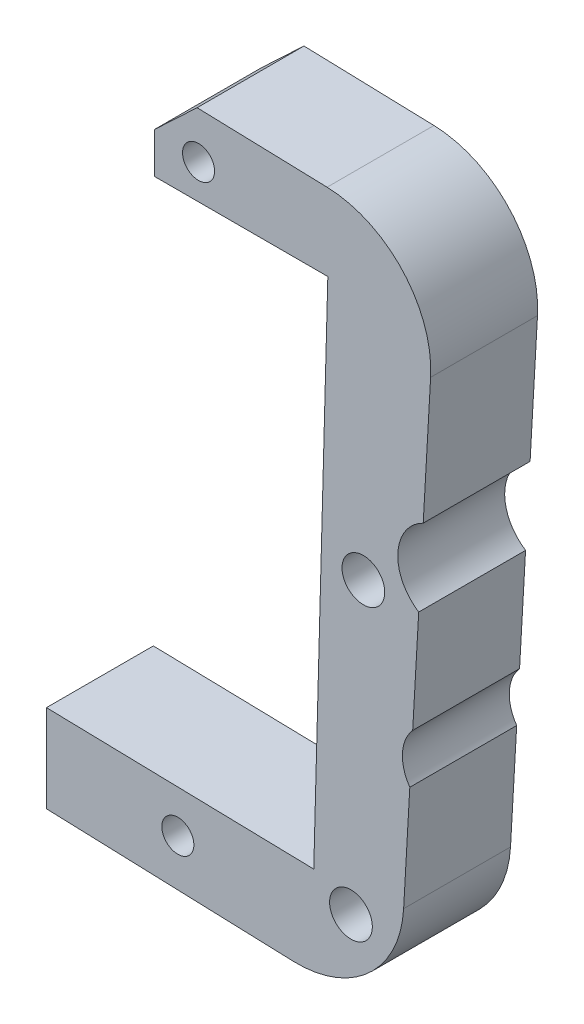
ISO-10303-21;
HEADER;
FILE_DESCRIPTION(('STEP AP214'),'2;1');
FILE_NAME('part.step','',(''),(''),'','','');
FILE_SCHEMA(('AUTOMOTIVE_DESIGN { 1 0 10303 214 1 1 1 1 }'));
ENDSEC;
DATA;
#1=APPLICATION_CONTEXT('core data for automotive mechanical design processes');
#2=APPLICATION_PROTOCOL_DEFINITION('international standard','automotive_design',2000,#1);
#3=PRODUCT_CONTEXT('',#1,'mechanical');
#4=PRODUCT('Part','Part','',(#3));
#5=PRODUCT_RELATED_PRODUCT_CATEGORY('part','',(#4));
#6=PRODUCT_DEFINITION_FORMATION('','',#4);
#7=PRODUCT_DEFINITION_CONTEXT('part definition',#1,'design');
#8=PRODUCT_DEFINITION('design','',#6,#7);
#9=PRODUCT_DEFINITION_SHAPE('','',#8);
#10=(LENGTH_UNIT() NAMED_UNIT(*) SI_UNIT(.MILLI.,.METRE.));
#11=(NAMED_UNIT(*) PLANE_ANGLE_UNIT() SI_UNIT($,.RADIAN.));
#12=(NAMED_UNIT(*) SI_UNIT($,.STERADIAN.) SOLID_ANGLE_UNIT());
#13=UNCERTAINTY_MEASURE_WITH_UNIT(LENGTH_MEASURE(1.E-05),#10,'distance_accuracy_value','');
#14=(GEOMETRIC_REPRESENTATION_CONTEXT(3) GLOBAL_UNCERTAINTY_ASSIGNED_CONTEXT((#13)) GLOBAL_UNIT_ASSIGNED_CONTEXT((#10,
#11,#12)) REPRESENTATION_CONTEXT('',''));
#15=CARTESIAN_POINT('',(0.,0.,0.));
#16=DIRECTION('',(0.,0.,1.));
#17=DIRECTION('',(1.,0.,0.));
#18=AXIS2_PLACEMENT_3D('',#15,#16,#17);
#19=CARTESIAN_POINT('',(71.9103372050038,19.8189163804485,5.));
#20=DIRECTION('',(0.,0.,-1.));
#21=DIRECTION('',(-1.,0.,0.));
#22=AXIS2_PLACEMENT_3D('',#19,#20,#21);
#23=PLANE('',#22);
#24=CARTESIAN_POINT('',(65.0760458232455,-4.95071954235128,5.));
#25=DIRECTION('',(0.,0.,1.));
#26=DIRECTION('',(1.,0.,0.));
#27=AXIS2_PLACEMENT_3D('',#24,#25,#26);
#28=CIRCLE('',#27,0.749999999999999);
#29=CARTESIAN_POINT('',(65.8260458232455,-4.95071954235128,5.));
#30=VERTEX_POINT('',#29);
#31=EDGE_CURVE('E330',#30,#30,#28,.T.);
#32=ORIENTED_EDGE('',*,*,#31,.F.);
#33=EDGE_LOOP('',(#32));
#34=FACE_BOUND('',#33,.T.);
#35=CARTESIAN_POINT('',(66.0462518315754,22.8323454487796,5.));
#36=DIRECTION('',(0.,0.,1.));
#37=DIRECTION('',(1.,0.,0.));
#38=AXIS2_PLACEMENT_3D('',#35,#36,#37);
#39=CIRCLE('',#38,0.749999999999999);
#40=CARTESIAN_POINT('',(66.7962518315754,22.8323454487796,5.));
#41=VERTEX_POINT('',#40);
#42=EDGE_CURVE('E322',#41,#41,#39,.T.);
#43=ORIENTED_EDGE('',*,*,#42,.F.);
#44=EDGE_LOOP('',(#43));
#45=FACE_BOUND('',#44,.T.);
#46=DIRECTION('',(-0.999562301749574,0.0295838625113943,0.));
#47=VECTOR('',#46,1.);
#48=CARTESIAN_POINT('',(63.9785920288581,25.0558602403801,5.));
#49=LINE('',#48,#47);
#50=CARTESIAN_POINT('',(72.0582565175607,24.8167278891964,5.));
#51=VERTEX_POINT('',#50);
#52=CARTESIAN_POINT('',(65.9777166323573,24.9966925153573,5.));
#53=VERTEX_POINT('',#52);
#54=EDGE_CURVE('E274',#51,#53,#49,.T.);
#55=ORIENTED_EDGE('',*,*,#54,.T.);
#56=DIRECTION('',(0.727716231581056,0.68587833199006,0.));
#57=VECTOR('',#56,1.);
#58=CARTESIAN_POINT('',(63.9785920288581,23.1125016879667,5.));
#59=LINE('',#58,#57);
#60=CARTESIAN_POINT('',(63.9785920288581,23.1125016879667,5.));
#61=VERTEX_POINT('',#60);
#62=EDGE_CURVE('E11',#53,#61,#59,.F.);
#63=ORIENTED_EDGE('',*,*,#62,.T.);
#64=DIRECTION('',(0.,-1.,0.));
#65=VECTOR('',#64,1.);
#66=CARTESIAN_POINT('',(63.9785920288581,21.2145614977327,5.));
#67=LINE('',#66,#65);
#68=CARTESIAN_POINT('',(63.9785920288581,21.2145614977327,5.));
#69=VERTEX_POINT('',#68);
#70=EDGE_CURVE('E166',#61,#69,#67,.T.);
#71=ORIENTED_EDGE('',*,*,#70,.T.);
#72=DIRECTION('',(1.,0.,0.));
#73=VECTOR('',#72,1.);
#74=CARTESIAN_POINT('',(72.0934757913562,21.2145614977327,5.));
#75=LINE('',#74,#73);
#76=CARTESIAN_POINT('',(72.0934757913562,21.2145614977327,5.));
#77=VERTEX_POINT('',#76);
#78=EDGE_CURVE('E161',#69,#77,#75,.T.);
#79=ORIENTED_EDGE('',*,*,#78,.T.);
#80=DIRECTION('',(-0.0270408255884992,-0.999634330018479,0.));
#81=VECTOR('',#80,1.);
#82=CARTESIAN_POINT('',(71.4351417341447,-3.12246630695344,5.));
#83=LINE('',#82,#81);
#84=CARTESIAN_POINT('',(71.4351417341447,-3.12246630695344,5.));
#85=VERTEX_POINT('',#84);
#86=EDGE_CURVE('E149',#77,#85,#83,.T.);
#87=ORIENTED_EDGE('',*,*,#86,.T.);
#88=DIRECTION('',(-0.999731963759344,0.0231516875817951,0.));
#89=VECTOR('',#88,1.);
#90=CARTESIAN_POINT('',(58.9304337087244,-2.83288359478581,5.));
#91=LINE('',#90,#89);
#92=CARTESIAN_POINT('',(58.9304337087244,-2.83288359478581,5.));
#93=VERTEX_POINT('',#92);
#94=EDGE_CURVE('E160',#85,#93,#91,.T.);
#95=ORIENTED_EDGE('',*,*,#94,.T.);
#96=DIRECTION('',(0.,-1.,0.));
#97=VECTOR('',#96,1.);
#98=CARTESIAN_POINT('',(58.9304337087244,-2.83288359478581,5.));
#99=LINE('',#98,#97);
#100=CARTESIAN_POINT('',(58.9304337087244,-6.93315341266548,5.));
#101=VERTEX_POINT('',#100);
#102=EDGE_CURVE('E301',#93,#101,#99,.T.);
#103=ORIENTED_EDGE('',*,*,#102,.T.);
#104=DIRECTION('',(0.999390827019095,-0.0348994967025162,0.));
#105=VECTOR('',#104,1.);
#106=CARTESIAN_POINT('',(58.9304337087244,-6.93315341266548,5.));
#107=LINE('',#106,#105);
#108=CARTESIAN_POINT('',(70.4737985935657,-7.33625659696834,5.));
#109=VERTEX_POINT('',#108);
#110=EDGE_CURVE('E298',#101,#109,#107,.T.);
#111=ORIENTED_EDGE('',*,*,#110,.T.);
#112=CARTESIAN_POINT('',(70.6482960770783,-2.33930246187286,5.));
#113=DIRECTION('',(0.,0.,1.));
#114=DIRECTION('',(-1.,0.,0.));
#115=AXIS2_PLACEMENT_3D('',#112,#113,#114);
#116=CIRCLE('',#115,5.);
#117=CARTESIAN_POINT('',(75.6402058210045,-2.62362113606581,5.));
#118=VERTEX_POINT('',#117);
#119=EDGE_CURVE('E295',#109,#118,#116,.T.);
#120=ORIENTED_EDGE('',*,*,#119,.T.);
#121=DIRECTION('',(0.0568637348385985,0.998381948785236,0.));
#122=VECTOR('',#121,1.);
#123=CARTESIAN_POINT('',(75.6402058210045,-2.62362113606581,5.));
#124=LINE('',#123,#122);
#125=CARTESIAN_POINT('',(75.9286269076461,2.44031649253629,5.));
#126=VERTEX_POINT('',#125);
#127=EDGE_CURVE('E292',#118,#126,#124,.T.);
#128=ORIENTED_EDGE('',*,*,#127,.T.);
#129=CARTESIAN_POINT('',(77.5,3.54030430037338,5.));
#130=DIRECTION('',(0.,0.,-1.));
#131=DIRECTION('',(1.,0.,0.));
#132=AXIS2_PLACEMENT_3D('',#129,#130,#131);
#133=CIRCLE('',#132,1.91812058347856);
#134=CARTESIAN_POINT('',(76.0636853419654,4.8115976480627,5.));
#135=VERTEX_POINT('',#134);
#136=EDGE_CURVE('E289',#126,#135,#133,.T.);
#137=ORIENTED_EDGE('',*,*,#136,.T.);
#138=DIRECTION('',(0.0568637348385989,0.998381948785236,0.));
#139=VECTOR('',#138,1.);
#140=CARTESIAN_POINT('',(76.0636853419654,4.8115976480627,5.));
#141=LINE('',#140,#139);
#142=CARTESIAN_POINT('',(76.3447433004722,9.74625755269379,5.));
#143=VERTEX_POINT('',#142);
#144=EDGE_CURVE('E286',#135,#143,#141,.T.);
#145=ORIENTED_EDGE('',*,*,#144,.T.);
#146=CARTESIAN_POINT('',(77.5,11.5403043003734,5.));
#147=DIRECTION('',(0.,0.,-1.));
#148=DIRECTION('',(1.,0.,0.));
#149=AXIS2_PLACEMENT_3D('',#146,#147,#148);
#150=CIRCLE('',#149,2.13382796276165);
#151=CARTESIAN_POINT('',(76.5559165715932,13.4539208384685,5.));
#152=VERTEX_POINT('',#151);
#153=EDGE_CURVE('E283',#143,#152,#150,.T.);
#154=ORIENTED_EDGE('',*,*,#153,.T.);
#155=DIRECTION('',(0.0568637348385969,0.998381948785236,0.));
#156=VECTOR('',#155,1.);
#157=CARTESIAN_POINT('',(76.5559165715932,13.4539208384685,5.));
#158=LINE('',#157,#156);
#159=CARTESIAN_POINT('',(76.90224694893,19.5345977062555,5.));
#160=VERTEX_POINT('',#159);
#161=EDGE_CURVE('E280',#152,#160,#158,.T.);
#162=ORIENTED_EDGE('',*,*,#161,.T.);
#163=CARTESIAN_POINT('',(71.9103372050038,19.8189163804485,5.));
#164=DIRECTION('',(0.,0.,1.));
#165=DIRECTION('',(-1.,0.,0.));
#166=AXIS2_PLACEMENT_3D('',#163,#164,#165);
#167=CIRCLE('',#166,5.);
#168=EDGE_CURVE('E277',#160,#51,#167,.T.);
#169=ORIENTED_EDGE('',*,*,#168,.T.);
#170=EDGE_LOOP('',(#55,#63,#71,#79,#87,#95,#103,#111,#120,#128,#137,#145,#154,#162,#169));
#171=FACE_BOUND('',#170,.T.);
#172=CARTESIAN_POINT('',(73.1761784981804,-4.09144878243071,5.));
#173=DIRECTION('',(0.,0.,1.));
#174=DIRECTION('',(1.,0.,0.));
#175=AXIS2_PLACEMENT_3D('',#172,#173,#174);
#176=CIRCLE('',#175,0.999999999999998);
#177=CARTESIAN_POINT('',(74.1761784981804,-4.09144878243071,5.));
#178=VERTEX_POINT('',#177);
#179=EDGE_CURVE('E271',#178,#178,#176,.T.);
#180=ORIENTED_EDGE('',*,*,#179,.F.);
#181=EDGE_LOOP('',(#180));
#182=FACE_BOUND('',#181,.T.);
#183=CARTESIAN_POINT('',(73.7561308819726,9.74625755269379,5.));
#184=DIRECTION('',(0.,0.,1.));
#185=DIRECTION('',(1.,0.,0.));
#186=AXIS2_PLACEMENT_3D('',#183,#184,#185);
#187=CIRCLE('',#186,0.999999999999998);
#188=CARTESIAN_POINT('',(74.7561308819726,9.74625755269379,5.));
#189=VERTEX_POINT('',#188);
#190=EDGE_CURVE('E310',#189,#189,#187,.T.);
#191=ORIENTED_EDGE('',*,*,#190,.F.);
#192=EDGE_LOOP('',(#191));
#193=FACE_BOUND('',#192,.T.);
#194=ADVANCED_FACE('F40',(#34,#45,#171,#182,#193),#23,.F.);
#195=CARTESIAN_POINT('',(71.9103372050038,19.8189163804485,0.));
#196=DIRECTION('',(0.,0.,-1.));
#197=DIRECTION('',(-1.,0.,0.));
#198=AXIS2_PLACEMENT_3D('',#195,#196,#197);
#199=PLANE('',#198);
#200=CARTESIAN_POINT('',(65.0760458232455,-4.95071954235128,0.));
#201=DIRECTION('',(0.,0.,1.));
#202=DIRECTION('',(1.,0.,0.));
#203=AXIS2_PLACEMENT_3D('',#200,#201,#202);
#204=CIRCLE('',#203,0.749999999999999);
#205=CARTESIAN_POINT('',(65.8260458232455,-4.95071954235128,0.));
#206=VERTEX_POINT('',#205);
#207=EDGE_CURVE('E318',#206,#206,#204,.T.);
#208=ORIENTED_EDGE('',*,*,#207,.T.);
#209=EDGE_LOOP('',(#208));
#210=FACE_BOUND('',#209,.T.);
#211=CARTESIAN_POINT('',(66.0462518315754,22.8323454487796,0.));
#212=DIRECTION('',(0.,0.,1.));
#213=DIRECTION('',(1.,0.,0.));
#214=AXIS2_PLACEMENT_3D('',#211,#212,#213);
#215=CIRCLE('',#214,0.749999999999999);
#216=CARTESIAN_POINT('',(66.7962518315754,22.8323454487796,0.));
#217=VERTEX_POINT('',#216);
#218=EDGE_CURVE('E326',#217,#217,#215,.T.);
#219=ORIENTED_EDGE('',*,*,#218,.T.);
#220=EDGE_LOOP('',(#219));
#221=FACE_BOUND('',#220,.T.);
#222=CARTESIAN_POINT('',(73.1761784981804,-4.09144878243071,0.));
#223=DIRECTION('',(0.,0.,1.));
#224=DIRECTION('',(1.,0.,0.));
#225=AXIS2_PLACEMENT_3D('',#222,#223,#224);
#226=CIRCLE('',#225,0.999999999999998);
#227=CARTESIAN_POINT('',(74.1761784981804,-4.09144878243071,0.));
#228=VERTEX_POINT('',#227);
#229=EDGE_CURVE('E306',#228,#228,#226,.T.);
#230=ORIENTED_EDGE('',*,*,#229,.T.);
#231=EDGE_LOOP('',(#230));
#232=FACE_BOUND('',#231,.T.);
#233=DIRECTION('',(0.,-1.,0.));
#234=VECTOR('',#233,1.);
#235=CARTESIAN_POINT('',(63.9785920288581,21.2145614977327,0.));
#236=LINE('',#235,#234);
#237=CARTESIAN_POINT('',(63.9785920288581,23.1125016879667,0.));
#238=VERTEX_POINT('',#237);
#239=CARTESIAN_POINT('',(63.9785920288581,21.2145614977327,0.));
#240=VERTEX_POINT('',#239);
#241=EDGE_CURVE('E171',#238,#240,#236,.T.);
#242=ORIENTED_EDGE('',*,*,#241,.F.);
#243=DIRECTION('',(-0.727716231581056,-0.68587833199006,0.));
#244=VECTOR('',#243,1.);
#245=CARTESIAN_POINT('',(66.5351034773871,25.5220340467832,0.));
#246=LINE('',#245,#244);
#247=CARTESIAN_POINT('',(65.9777166323573,24.9966925153573,0.));
#248=VERTEX_POINT('',#247);
#249=EDGE_CURVE('E64',#238,#248,#246,.F.);
#250=ORIENTED_EDGE('',*,*,#249,.T.);
#251=DIRECTION('',(-0.999562301749574,0.0295838625113943,0.));
#252=VECTOR('',#251,1.);
#253=CARTESIAN_POINT('',(63.9785920288581,25.0558602403801,0.));
#254=LINE('',#253,#252);
#255=CARTESIAN_POINT('',(72.0582565175607,24.8167278891964,0.));
#256=VERTEX_POINT('',#255);
#257=EDGE_CURVE('E233',#256,#248,#254,.T.);
#258=ORIENTED_EDGE('',*,*,#257,.F.);
#259=CARTESIAN_POINT('',(71.9103372050038,19.8189163804485,0.));
#260=DIRECTION('',(0.,0.,1.));
#261=DIRECTION('',(-1.,0.,0.));
#262=AXIS2_PLACEMENT_3D('',#259,#260,#261);
#263=CIRCLE('',#262,5.);
#264=CARTESIAN_POINT('',(76.90224694893,19.5345977062555,0.));
#265=VERTEX_POINT('',#264);
#266=EDGE_CURVE('E236',#265,#256,#263,.T.);
#267=ORIENTED_EDGE('',*,*,#266,.F.);
#268=DIRECTION('',(0.0568637348385969,0.998381948785236,0.));
#269=VECTOR('',#268,1.);
#270=CARTESIAN_POINT('',(76.5559165715932,13.4539208384685,0.));
#271=LINE('',#270,#269);
#272=CARTESIAN_POINT('',(76.5559165715932,13.4539208384685,0.));
#273=VERTEX_POINT('',#272);
#274=EDGE_CURVE('E239',#273,#265,#271,.T.);
#275=ORIENTED_EDGE('',*,*,#274,.F.);
#276=CARTESIAN_POINT('',(77.5,11.5403043003734,0.));
#277=DIRECTION('',(0.,0.,-1.));
#278=DIRECTION('',(1.,0.,0.));
#279=AXIS2_PLACEMENT_3D('',#276,#277,#278);
#280=CIRCLE('',#279,2.13382796276165);
#281=CARTESIAN_POINT('',(76.3447433004722,9.74625755269379,0.));
#282=VERTEX_POINT('',#281);
#283=EDGE_CURVE('E242',#282,#273,#280,.T.);
#284=ORIENTED_EDGE('',*,*,#283,.F.);
#285=DIRECTION('',(0.0568637348385989,0.998381948785236,0.));
#286=VECTOR('',#285,1.);
#287=CARTESIAN_POINT('',(76.0636853419654,4.8115976480627,0.));
#288=LINE('',#287,#286);
#289=CARTESIAN_POINT('',(76.0636853419654,4.8115976480627,0.));
#290=VERTEX_POINT('',#289);
#291=EDGE_CURVE('E245',#290,#282,#288,.T.);
#292=ORIENTED_EDGE('',*,*,#291,.F.);
#293=CARTESIAN_POINT('',(77.5,3.54030430037338,0.));
#294=DIRECTION('',(0.,0.,-1.));
#295=DIRECTION('',(1.,0.,0.));
#296=AXIS2_PLACEMENT_3D('',#293,#294,#295);
#297=CIRCLE('',#296,1.91812058347856);
#298=CARTESIAN_POINT('',(75.9286269076461,2.44031649253629,0.));
#299=VERTEX_POINT('',#298);
#300=EDGE_CURVE('E248',#299,#290,#297,.T.);
#301=ORIENTED_EDGE('',*,*,#300,.F.);
#302=DIRECTION('',(0.0568637348385985,0.998381948785236,0.));
#303=VECTOR('',#302,1.);
#304=CARTESIAN_POINT('',(75.6402058210045,-2.62362113606581,0.));
#305=LINE('',#304,#303);
#306=CARTESIAN_POINT('',(75.6402058210045,-2.62362113606581,0.));
#307=VERTEX_POINT('',#306);
#308=EDGE_CURVE('E251',#307,#299,#305,.T.);
#309=ORIENTED_EDGE('',*,*,#308,.F.);
#310=CARTESIAN_POINT('',(70.6482960770783,-2.33930246187286,0.));
#311=DIRECTION('',(0.,0.,1.));
#312=DIRECTION('',(-1.,0.,0.));
#313=AXIS2_PLACEMENT_3D('',#310,#311,#312);
#314=CIRCLE('',#313,5.);
#315=CARTESIAN_POINT('',(70.4737985935657,-7.33625659696834,0.));
#316=VERTEX_POINT('',#315);
#317=EDGE_CURVE('E254',#316,#307,#314,.T.);
#318=ORIENTED_EDGE('',*,*,#317,.F.);
#319=DIRECTION('',(0.999390827019095,-0.0348994967025162,0.));
#320=VECTOR('',#319,1.);
#321=CARTESIAN_POINT('',(58.9304337087244,-6.93315341266548,0.));
#322=LINE('',#321,#320);
#323=CARTESIAN_POINT('',(58.9304337087244,-6.93315341266548,0.));
#324=VERTEX_POINT('',#323);
#325=EDGE_CURVE('E257',#324,#316,#322,.T.);
#326=ORIENTED_EDGE('',*,*,#325,.F.);
#327=DIRECTION('',(0.,-1.,0.));
#328=VECTOR('',#327,1.);
#329=CARTESIAN_POINT('',(58.9304337087244,-2.83288359478581,0.));
#330=LINE('',#329,#328);
#331=CARTESIAN_POINT('',(58.9304337087244,-2.83288359478581,0.));
#332=VERTEX_POINT('',#331);
#333=EDGE_CURVE('E260',#332,#324,#330,.T.);
#334=ORIENTED_EDGE('',*,*,#333,.F.);
#335=DIRECTION('',(-0.999731963759344,0.0231516875817951,0.));
#336=VECTOR('',#335,1.);
#337=CARTESIAN_POINT('',(58.9304337087244,-2.83288359478581,0.));
#338=LINE('',#337,#336);
#339=CARTESIAN_POINT('',(71.4351417341447,-3.12246630695344,0.));
#340=VERTEX_POINT('',#339);
#341=EDGE_CURVE('E263',#340,#332,#338,.T.);
#342=ORIENTED_EDGE('',*,*,#341,.F.);
#343=DIRECTION('',(-0.0270408255884992,-0.999634330018479,0.));
#344=VECTOR('',#343,1.);
#345=CARTESIAN_POINT('',(71.4351417341447,-3.12246630695344,0.));
#346=LINE('',#345,#344);
#347=CARTESIAN_POINT('',(72.0934757913562,21.2145614977327,0.));
#348=VERTEX_POINT('',#347);
#349=EDGE_CURVE('E266',#348,#340,#346,.T.);
#350=ORIENTED_EDGE('',*,*,#349,.F.);
#351=DIRECTION('',(1.,0.,0.));
#352=VECTOR('',#351,1.);
#353=CARTESIAN_POINT('',(72.0934757913562,21.2145614977327,0.));
#354=LINE('',#353,#352);
#355=EDGE_CURVE('E175',#240,#348,#354,.T.);
#356=ORIENTED_EDGE('',*,*,#355,.F.);
#357=EDGE_LOOP('',(#242,#250,#258,#267,#275,#284,#292,#301,#309,#318,#326,#334,#342,#350,#356));
#358=FACE_BOUND('',#357,.T.);
#359=CARTESIAN_POINT('',(73.7561308819726,9.74625755269379,0.));
#360=DIRECTION('',(0.,0.,1.));
#361=DIRECTION('',(1.,0.,0.));
#362=AXIS2_PLACEMENT_3D('',#359,#360,#361);
#363=CIRCLE('',#362,0.999999999999998);
#364=CARTESIAN_POINT('',(74.7561308819726,9.74625755269379,0.));
#365=VERTEX_POINT('',#364);
#366=EDGE_CURVE('E314',#365,#365,#363,.T.);
#367=ORIENTED_EDGE('',*,*,#366,.T.);
#368=EDGE_LOOP('',(#367));
#369=FACE_BOUND('',#368,.T.);
#370=ADVANCED_FACE('F338',(#210,#221,#232,#358,#369),#199,.T.);
#371=CARTESIAN_POINT('',(72.0934757913562,21.2145614977327,5.));
#372=DIRECTION('',(0.,1.,0.));
#373=DIRECTION('',(0.,0.,1.));
#374=AXIS2_PLACEMENT_3D('',#371,#372,#373);
#375=PLANE('',#374);
#376=ORIENTED_EDGE('',*,*,#355,.T.);
#377=DIRECTION('',(0.,0.,-1.));
#378=VECTOR('',#377,1.);
#379=CARTESIAN_POINT('',(72.0934757913562,21.2145614977327,5.));
#380=LINE('',#379,#378);
#381=EDGE_CURVE('E153',#77,#348,#380,.T.);
#382=ORIENTED_EDGE('',*,*,#381,.F.);
#383=ORIENTED_EDGE('',*,*,#78,.F.);
#384=DIRECTION('',(0.,0.,-1.));
#385=VECTOR('',#384,1.);
#386=CARTESIAN_POINT('',(63.9785920288581,21.2145614977327,5.));
#387=LINE('',#386,#385);
#388=EDGE_CURVE('E228',#69,#240,#387,.T.);
#389=ORIENTED_EDGE('',*,*,#388,.T.);
#390=EDGE_LOOP('',(#376,#382,#383,#389));
#391=FACE_BOUND('',#390,.T.);
#392=ADVANCED_FACE('F173',(#391),#375,.F.);
#393=CARTESIAN_POINT('',(71.4351417341447,-3.12246630695344,5.));
#394=DIRECTION('',(0.999634330018478,-0.0270408255884992,0.));
#395=DIRECTION('',(0.0270408255884992,0.999634330018479,0.));
#396=AXIS2_PLACEMENT_3D('',#393,#394,#395);
#397=PLANE('',#396);
#398=ORIENTED_EDGE('',*,*,#349,.T.);
#399=DIRECTION('',(0.,0.,-1.));
#400=VECTOR('',#399,1.);
#401=CARTESIAN_POINT('',(71.4351417341447,-3.12246630695344,5.));
#402=LINE('',#401,#400);
#403=EDGE_CURVE('E156',#85,#340,#402,.T.);
#404=ORIENTED_EDGE('',*,*,#403,.F.);
#405=ORIENTED_EDGE('',*,*,#86,.F.);
#406=ORIENTED_EDGE('',*,*,#381,.T.);
#407=EDGE_LOOP('',(#398,#404,#405,#406));
#408=FACE_BOUND('',#407,.T.);
#409=ADVANCED_FACE('F151',(#408),#397,.F.);
#410=CARTESIAN_POINT('',(58.9304337087244,-2.83288359478581,5.));
#411=DIRECTION('',(-0.0231516875817951,-0.999731963759344,0.));
#412=DIRECTION('',(0.999731963759344,-0.0231516875817951,0.));
#413=AXIS2_PLACEMENT_3D('',#410,#411,#412);
#414=PLANE('',#413);
#415=ORIENTED_EDGE('',*,*,#341,.T.);
#416=DIRECTION('',(0.,0.,-1.));
#417=VECTOR('',#416,1.);
#418=CARTESIAN_POINT('',(58.9304337087244,-2.83288359478581,5.));
#419=LINE('',#418,#417);
#420=EDGE_CURVE('E183',#93,#332,#419,.T.);
#421=ORIENTED_EDGE('',*,*,#420,.F.);
#422=ORIENTED_EDGE('',*,*,#94,.F.);
#423=ORIENTED_EDGE('',*,*,#403,.T.);
#424=EDGE_LOOP('',(#415,#421,#422,#423));
#425=FACE_BOUND('',#424,.T.);
#426=ADVANCED_FACE('F412',(#425),#414,.F.);
#427=CARTESIAN_POINT('',(58.9304337087244,-2.83288359478581,5.));
#428=DIRECTION('',(1.,0.,0.));
#429=DIRECTION('',(0.,0.,-1.));
#430=AXIS2_PLACEMENT_3D('',#427,#428,#429);
#431=PLANE('',#430);
#432=ORIENTED_EDGE('',*,*,#333,.T.);
#433=DIRECTION('',(0.,0.,-1.));
#434=VECTOR('',#433,1.);
#435=CARTESIAN_POINT('',(58.9304337087244,-6.93315341266548,5.));
#436=LINE('',#435,#434);
#437=EDGE_CURVE('E192',#101,#324,#436,.T.);
#438=ORIENTED_EDGE('',*,*,#437,.F.);
#439=ORIENTED_EDGE('',*,*,#102,.F.);
#440=ORIENTED_EDGE('',*,*,#420,.T.);
#441=EDGE_LOOP('',(#432,#438,#439,#440));
#442=FACE_BOUND('',#441,.T.);
#443=ADVANCED_FACE('F408',(#442),#431,.F.);
#444=CARTESIAN_POINT('',(58.9304337087244,-6.93315341266548,5.));
#445=DIRECTION('',(0.0348994967025162,0.999390827019095,0.));
#446=DIRECTION('',(-0.999390827019095,0.0348994967025162,0.));
#447=AXIS2_PLACEMENT_3D('',#444,#445,#446);
#448=PLANE('',#447);
#449=ORIENTED_EDGE('',*,*,#325,.T.);
#450=DIRECTION('',(0.,0.,-1.));
#451=VECTOR('',#450,1.);
#452=CARTESIAN_POINT('',(70.4737985935657,-7.33625659696834,5.));
#453=LINE('',#452,#451);
#454=EDGE_CURVE('E196',#109,#316,#453,.T.);
#455=ORIENTED_EDGE('',*,*,#454,.F.);
#456=ORIENTED_EDGE('',*,*,#110,.F.);
#457=ORIENTED_EDGE('',*,*,#437,.T.);
#458=EDGE_LOOP('',(#449,#455,#456,#457));
#459=FACE_BOUND('',#458,.T.);
#460=ADVANCED_FACE('F404',(#459),#448,.F.);
#461=CARTESIAN_POINT('',(70.6482960770783,-2.33930246187286,5.));
#462=DIRECTION('',(0.,0.,-1.));
#463=DIRECTION('',(-1.,0.,0.));
#464=AXIS2_PLACEMENT_3D('',#461,#462,#463);
#465=CYLINDRICAL_SURFACE('',#464,5.);
#466=ORIENTED_EDGE('',*,*,#317,.T.);
#467=DIRECTION('',(0.,0.,-1.));
#468=VECTOR('',#467,1.);
#469=CARTESIAN_POINT('',(75.6402058210045,-2.62362113606581,5.));
#470=LINE('',#469,#468);
#471=EDGE_CURVE('E200',#118,#307,#470,.T.);
#472=ORIENTED_EDGE('',*,*,#471,.F.);
#473=ORIENTED_EDGE('',*,*,#119,.F.);
#474=ORIENTED_EDGE('',*,*,#454,.T.);
#475=EDGE_LOOP('',(#466,#472,#473,#474));
#476=FACE_BOUND('',#475,.T.);
#477=ADVANCED_FACE('F400',(#476),#465,.T.);
#478=CARTESIAN_POINT('',(75.6402058210045,-2.62362113606581,5.));
#479=DIRECTION('',(-0.998381948785236,0.0568637348385985,0.));
#480=DIRECTION('',(-0.0568637348385985,-0.998381948785236,0.));
#481=AXIS2_PLACEMENT_3D('',#478,#479,#480);
#482=PLANE('',#481);
#483=ORIENTED_EDGE('',*,*,#308,.T.);
#484=DIRECTION('',(0.,0.,-1.));
#485=VECTOR('',#484,1.);
#486=CARTESIAN_POINT('',(75.9286269076461,2.44031649253629,5.));
#487=LINE('',#486,#485);
#488=EDGE_CURVE('E204',#126,#299,#487,.T.);
#489=ORIENTED_EDGE('',*,*,#488,.F.);
#490=ORIENTED_EDGE('',*,*,#127,.F.);
#491=ORIENTED_EDGE('',*,*,#471,.T.);
#492=EDGE_LOOP('',(#483,#489,#490,#491));
#493=FACE_BOUND('',#492,.T.);
#494=ADVANCED_FACE('F396',(#493),#482,.F.);
#495=CARTESIAN_POINT('',(77.5,3.54030430037338,5.));
#496=DIRECTION('',(0.,0.,-1.));
#497=DIRECTION('',(-1.,0.,0.));
#498=AXIS2_PLACEMENT_3D('',#495,#496,#497);
#499=CYLINDRICAL_SURFACE('',#498,1.91812058347856);
#500=ORIENTED_EDGE('',*,*,#300,.T.);
#501=DIRECTION('',(0.,0.,-1.));
#502=VECTOR('',#501,1.);
#503=CARTESIAN_POINT('',(76.0636853419654,4.8115976480627,5.));
#504=LINE('',#503,#502);
#505=EDGE_CURVE('E208',#135,#290,#504,.T.);
#506=ORIENTED_EDGE('',*,*,#505,.F.);
#507=ORIENTED_EDGE('',*,*,#136,.F.);
#508=ORIENTED_EDGE('',*,*,#488,.T.);
#509=EDGE_LOOP('',(#500,#506,#507,#508));
#510=FACE_BOUND('',#509,.T.);
#511=ADVANCED_FACE('F392',(#510),#499,.F.);
#512=CARTESIAN_POINT('',(76.0636853419654,4.8115976480627,5.));
#513=DIRECTION('',(-0.998381948785236,0.0568637348385989,0.));
#514=DIRECTION('',(-0.0568637348385989,-0.998381948785236,0.));
#515=AXIS2_PLACEMENT_3D('',#512,#513,#514);
#516=PLANE('',#515);
#517=ORIENTED_EDGE('',*,*,#291,.T.);
#518=DIRECTION('',(0.,0.,-1.));
#519=VECTOR('',#518,1.);
#520=CARTESIAN_POINT('',(76.3447433004722,9.74625755269379,5.));
#521=LINE('',#520,#519);
#522=EDGE_CURVE('E212',#143,#282,#521,.T.);
#523=ORIENTED_EDGE('',*,*,#522,.F.);
#524=ORIENTED_EDGE('',*,*,#144,.F.);
#525=ORIENTED_EDGE('',*,*,#505,.T.);
#526=EDGE_LOOP('',(#517,#523,#524,#525));
#527=FACE_BOUND('',#526,.T.);
#528=ADVANCED_FACE('F388',(#527),#516,.F.);
#529=CARTESIAN_POINT('',(77.5,11.5403043003734,5.));
#530=DIRECTION('',(0.,0.,-1.));
#531=DIRECTION('',(-1.,0.,0.));
#532=AXIS2_PLACEMENT_3D('',#529,#530,#531);
#533=CYLINDRICAL_SURFACE('',#532,2.13382796276165);
#534=ORIENTED_EDGE('',*,*,#283,.T.);
#535=DIRECTION('',(0.,0.,-1.));
#536=VECTOR('',#535,1.);
#537=CARTESIAN_POINT('',(76.5559165715932,13.4539208384685,5.));
#538=LINE('',#537,#536);
#539=EDGE_CURVE('E216',#152,#273,#538,.T.);
#540=ORIENTED_EDGE('',*,*,#539,.F.);
#541=ORIENTED_EDGE('',*,*,#153,.F.);
#542=ORIENTED_EDGE('',*,*,#522,.T.);
#543=EDGE_LOOP('',(#534,#540,#541,#542));
#544=FACE_BOUND('',#543,.T.);
#545=ADVANCED_FACE('F384',(#544),#533,.F.);
#546=CARTESIAN_POINT('',(76.5559165715932,13.4539208384685,5.));
#547=DIRECTION('',(-0.998381948785236,0.0568637348385969,0.));
#548=DIRECTION('',(-0.0568637348385969,-0.998381948785236,0.));
#549=AXIS2_PLACEMENT_3D('',#546,#547,#548);
#550=PLANE('',#549);
#551=ORIENTED_EDGE('',*,*,#274,.T.);
#552=DIRECTION('',(0.,0.,-1.));
#553=VECTOR('',#552,1.);
#554=CARTESIAN_POINT('',(76.90224694893,19.5345977062555,5.));
#555=LINE('',#554,#553);
#556=EDGE_CURVE('E220',#160,#265,#555,.T.);
#557=ORIENTED_EDGE('',*,*,#556,.F.);
#558=ORIENTED_EDGE('',*,*,#161,.F.);
#559=ORIENTED_EDGE('',*,*,#539,.T.);
#560=EDGE_LOOP('',(#551,#557,#558,#559));
#561=FACE_BOUND('',#560,.T.);
#562=ADVANCED_FACE('F380',(#561),#550,.F.);
#563=CARTESIAN_POINT('',(71.9103372050038,19.8189163804485,5.));
#564=DIRECTION('',(0.,0.,-1.));
#565=DIRECTION('',(-1.,0.,0.));
#566=AXIS2_PLACEMENT_3D('',#563,#564,#565);
#567=CYLINDRICAL_SURFACE('',#566,5.);
#568=ORIENTED_EDGE('',*,*,#266,.T.);
#569=DIRECTION('',(0.,0.,-1.));
#570=VECTOR('',#569,1.);
#571=CARTESIAN_POINT('',(72.0582565175607,24.8167278891964,5.));
#572=LINE('',#571,#570);
#573=EDGE_CURVE('E224',#51,#256,#572,.T.);
#574=ORIENTED_EDGE('',*,*,#573,.F.);
#575=ORIENTED_EDGE('',*,*,#168,.F.);
#576=ORIENTED_EDGE('',*,*,#556,.T.);
#577=EDGE_LOOP('',(#568,#574,#575,#576));
#578=FACE_BOUND('',#577,.T.);
#579=ADVANCED_FACE('F377',(#578),#567,.T.);
#580=CARTESIAN_POINT('',(63.9785920288581,25.0558602403801,5.));
#581=DIRECTION('',(-0.0295838625113943,-0.999562301749574,0.));
#582=DIRECTION('',(0.999562301749574,-0.0295838625113943,0.));
#583=AXIS2_PLACEMENT_3D('',#580,#581,#582);
#584=PLANE('',#583);
#585=ORIENTED_EDGE('',*,*,#257,.T.);
#586=DIRECTION('',(0.,0.,1.));
#587=VECTOR('',#586,1.);
#588=CARTESIAN_POINT('',(65.9777166323573,24.9966925153573,5.));
#589=LINE('',#588,#587);
#590=EDGE_CURVE('E50',#248,#53,#589,.T.);
#591=ORIENTED_EDGE('',*,*,#590,.T.);
#592=ORIENTED_EDGE('',*,*,#54,.F.);
#593=ORIENTED_EDGE('',*,*,#573,.T.);
#594=EDGE_LOOP('',(#585,#591,#592,#593));
#595=FACE_BOUND('',#594,.T.);
#596=ADVANCED_FACE('F373',(#595),#584,.F.);
#597=CARTESIAN_POINT('',(63.9785920288581,21.2145614977327,5.));
#598=DIRECTION('',(1.,0.,0.));
#599=DIRECTION('',(0.,0.,-1.));
#600=AXIS2_PLACEMENT_3D('',#597,#598,#599);
#601=PLANE('',#600);
#602=ORIENTED_EDGE('',*,*,#70,.F.);
#603=DIRECTION('',(0.,0.,-1.));
#604=VECTOR('',#603,1.);
#605=CARTESIAN_POINT('',(63.9785920288581,23.1125016879667,5.));
#606=LINE('',#605,#604);
#607=EDGE_CURVE('E177',#61,#238,#606,.T.);
#608=ORIENTED_EDGE('',*,*,#607,.T.);
#609=ORIENTED_EDGE('',*,*,#241,.T.);
#610=ORIENTED_EDGE('',*,*,#388,.F.);
#611=EDGE_LOOP('',(#602,#608,#609,#610));
#612=FACE_BOUND('',#611,.T.);
#613=ADVANCED_FACE('F366',(#612),#601,.F.);
#614=CARTESIAN_POINT('',(73.1761784981804,-4.09144878243071,5.));
#615=DIRECTION('',(0.,0.,-1.));
#616=DIRECTION('',(-1.,0.,0.));
#617=AXIS2_PLACEMENT_3D('',#614,#615,#616);
#618=CYLINDRICAL_SURFACE('',#617,0.999999999999998);
#619=ORIENTED_EDGE('',*,*,#179,.T.);
#620=EDGE_LOOP('',(#619));
#621=FACE_BOUND('',#620,.T.);
#622=ORIENTED_EDGE('',*,*,#229,.F.);
#623=EDGE_LOOP('',(#622));
#624=FACE_BOUND('',#623,.T.);
#625=ADVANCED_FACE('F360',(#621,#624),#618,.F.);
#626=CARTESIAN_POINT('',(73.7561308819726,9.74625755269379,5.));
#627=DIRECTION('',(0.,0.,-1.));
#628=DIRECTION('',(-1.,0.,0.));
#629=AXIS2_PLACEMENT_3D('',#626,#627,#628);
#630=CYLINDRICAL_SURFACE('',#629,0.999999999999998);
#631=ORIENTED_EDGE('',*,*,#190,.T.);
#632=EDGE_LOOP('',(#631));
#633=FACE_BOUND('',#632,.T.);
#634=ORIENTED_EDGE('',*,*,#366,.F.);
#635=EDGE_LOOP('',(#634));
#636=FACE_BOUND('',#635,.T.);
#637=ADVANCED_FACE('F354',(#633,#636),#630,.F.);
#638=CARTESIAN_POINT('',(66.0462518315754,22.8323454487796,0.));
#639=DIRECTION('',(0.,0.,1.));
#640=DIRECTION('',(1.,0.,0.));
#641=AXIS2_PLACEMENT_3D('',#638,#639,#640);
#642=CYLINDRICAL_SURFACE('',#641,0.749999999999999);
#643=ORIENTED_EDGE('',*,*,#218,.F.);
#644=EDGE_LOOP('',(#643));
#645=FACE_BOUND('',#644,.T.);
#646=ORIENTED_EDGE('',*,*,#42,.T.);
#647=EDGE_LOOP('',(#646));
#648=FACE_BOUND('',#647,.T.);
#649=ADVANCED_FACE('F344',(#645,#648),#642,.F.);
#650=CARTESIAN_POINT('',(65.0760458232455,-4.95071954235128,0.));
#651=DIRECTION('',(0.,0.,1.));
#652=DIRECTION('',(1.,0.,0.));
#653=AXIS2_PLACEMENT_3D('',#650,#651,#652);
#654=CYLINDRICAL_SURFACE('',#653,0.749999999999999);
#655=ORIENTED_EDGE('',*,*,#207,.F.);
#656=EDGE_LOOP('',(#655));
#657=FACE_BOUND('',#656,.T.);
#658=ORIENTED_EDGE('',*,*,#31,.T.);
#659=EDGE_LOOP('',(#658));
#660=FACE_BOUND('',#659,.T.);
#661=ADVANCED_FACE('F341',(#657,#660),#654,.F.);
#662=CARTESIAN_POINT('',(63.9785920288581,23.1125016879667,5.));
#663=DIRECTION('',(0.68587833199006,-0.727716231581056,0.));
#664=DIRECTION('',(0.,0.,-1.));
#665=AXIS2_PLACEMENT_3D('',#662,#663,#664);
#666=PLANE('',#665);
#667=ORIENTED_EDGE('',*,*,#62,.F.);
#668=ORIENTED_EDGE('',*,*,#590,.F.);
#669=ORIENTED_EDGE('',*,*,#249,.F.);
#670=ORIENTED_EDGE('',*,*,#607,.F.);
#671=EDGE_LOOP('',(#667,#668,#669,#670));
#672=FACE_BOUND('',#671,.T.);
#673=ADVANCED_FACE('F43',(#672),#666,.F.);
#674=CLOSED_SHELL('',(#194,#370,#392,#409,#426,#443,#460,#477,#494,#511,#528,#545,#562,#579,
#596,#613,#625,#637,#649,#661,#673));
#675=MANIFOLD_SOLID_BREP('B2',#674);
#676=ADVANCED_BREP_SHAPE_REPRESENTATION('',(#18,#675),#14);
#677=SHAPE_DEFINITION_REPRESENTATION(#9,#676);
ENDSEC;
END-ISO-10303-21;
